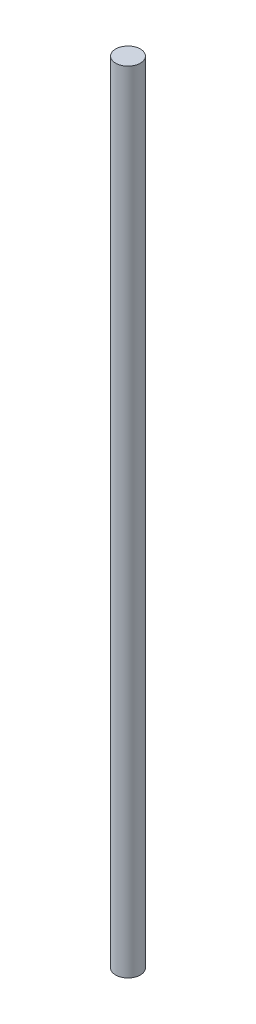
ISO-10303-21;
HEADER;
FILE_DESCRIPTION(('STEP AP214'),'2;1');
FILE_NAME('part.step','',(''),(''),'','','');
FILE_SCHEMA(('AUTOMOTIVE_DESIGN { 1 0 10303 214 1 1 1 1 }'));
ENDSEC;
DATA;
#1=APPLICATION_CONTEXT('core data for automotive mechanical design processes');
#2=APPLICATION_PROTOCOL_DEFINITION('international standard','automotive_design',2000,#1);
#3=PRODUCT_CONTEXT('',#1,'mechanical');
#4=PRODUCT('Part','Part','',(#3));
#5=PRODUCT_RELATED_PRODUCT_CATEGORY('part','',(#4));
#6=PRODUCT_DEFINITION_FORMATION('','',#4);
#7=PRODUCT_DEFINITION_CONTEXT('part definition',#1,'design');
#8=PRODUCT_DEFINITION('design','',#6,#7);
#9=PRODUCT_DEFINITION_SHAPE('','',#8);
#10=(LENGTH_UNIT() NAMED_UNIT(*) SI_UNIT(.MILLI.,.METRE.));
#11=(NAMED_UNIT(*) PLANE_ANGLE_UNIT() SI_UNIT($,.RADIAN.));
#12=(NAMED_UNIT(*) SI_UNIT($,.STERADIAN.) SOLID_ANGLE_UNIT());
#13=UNCERTAINTY_MEASURE_WITH_UNIT(LENGTH_MEASURE(1.E-05),#10,'distance_accuracy_value','');
#14=(GEOMETRIC_REPRESENTATION_CONTEXT(3) GLOBAL_UNCERTAINTY_ASSIGNED_CONTEXT((#13)) GLOBAL_UNIT_ASSIGNED_CONTEXT((#10,
#11,#12)) REPRESENTATION_CONTEXT('',''));
#15=CARTESIAN_POINT('',(0.,0.,0.));
#16=DIRECTION('',(0.,0.,1.));
#17=DIRECTION('',(1.,0.,0.));
#18=AXIS2_PLACEMENT_3D('',#15,#16,#17);
#19=CARTESIAN_POINT('',(0.,152.4,0.));
#20=DIRECTION('',(0.,-1.,0.));
#21=DIRECTION('',(0.,0.,-1.));
#22=AXIS2_PLACEMENT_3D('',#19,#20,#21);
#23=CYLINDRICAL_SURFACE('',#22,2.38125);
#24=CARTESIAN_POINT('',(0.,152.4,0.));
#25=DIRECTION('',(0.,1.,0.));
#26=DIRECTION('',(0.,0.,1.));
#27=AXIS2_PLACEMENT_3D('',#24,#25,#26);
#28=CIRCLE('',#27,2.38125);
#29=CARTESIAN_POINT('',(0.,152.4,2.38125));
#30=VERTEX_POINT('',#29);
#31=EDGE_CURVE('E10',#30,#30,#28,.T.);
#32=ORIENTED_EDGE('',*,*,#31,.F.);
#33=EDGE_LOOP('',(#32));
#34=FACE_BOUND('',#33,.T.);
#35=CARTESIAN_POINT('',(0.,0.,0.));
#36=DIRECTION('',(0.,1.,0.));
#37=DIRECTION('',(0.,0.,1.));
#38=AXIS2_PLACEMENT_3D('',#35,#36,#37);
#39=CIRCLE('',#38,2.38125);
#40=CARTESIAN_POINT('',(0.,0.,2.38125));
#41=VERTEX_POINT('',#40);
#42=EDGE_CURVE('E34',#41,#41,#39,.T.);
#43=ORIENTED_EDGE('',*,*,#42,.T.);
#44=EDGE_LOOP('',(#43));
#45=FACE_BOUND('',#44,.T.);
#46=ADVANCED_FACE('F31',(#34,#45),#23,.T.);
#47=CARTESIAN_POINT('',(0.,152.4,0.));
#48=DIRECTION('',(0.,1.,0.));
#49=DIRECTION('',(0.,0.,1.));
#50=AXIS2_PLACEMENT_3D('',#47,#48,#49);
#51=PLANE('',#50);
#52=ORIENTED_EDGE('',*,*,#31,.T.);
#53=EDGE_LOOP('',(#52));
#54=FACE_BOUND('',#53,.T.);
#55=ADVANCED_FACE('F46',(#54),#51,.T.);
#56=CARTESIAN_POINT('',(0.,0.,0.));
#57=DIRECTION('',(0.,1.,0.));
#58=DIRECTION('',(0.,0.,1.));
#59=AXIS2_PLACEMENT_3D('',#56,#57,#58);
#60=PLANE('',#59);
#61=ORIENTED_EDGE('',*,*,#42,.F.);
#62=EDGE_LOOP('',(#61));
#63=FACE_BOUND('',#62,.T.);
#64=ADVANCED_FACE('F44',(#63),#60,.F.);
#65=CLOSED_SHELL('',(#46,#55,#64));
#66=MANIFOLD_SOLID_BREP('B2',#65);
#67=ADVANCED_BREP_SHAPE_REPRESENTATION('',(#18,#66),#14);
#68=SHAPE_DEFINITION_REPRESENTATION(#9,#67);
ENDSEC;
END-ISO-10303-21;
